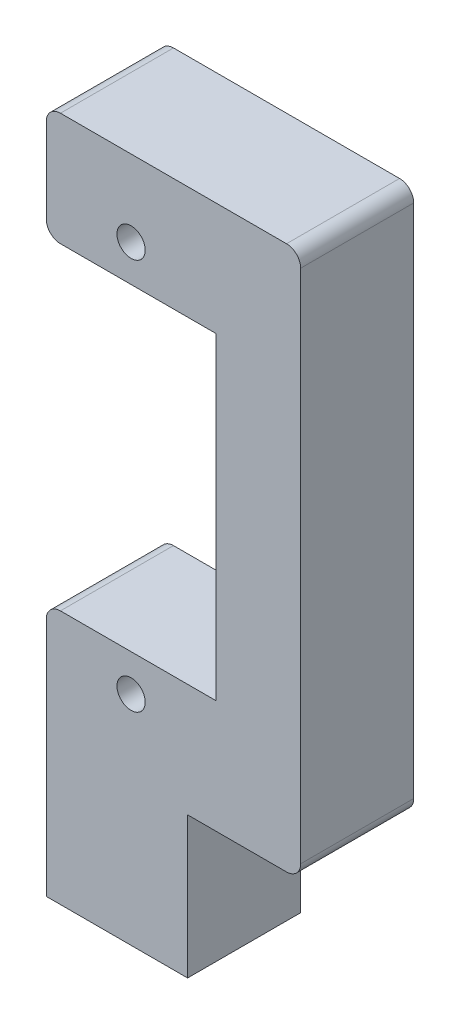
ISO-10303-21;
HEADER;
FILE_DESCRIPTION(('STEP AP214'),'2;1');
FILE_NAME('part.step','',(''),(''),'','','');
FILE_SCHEMA(('AUTOMOTIVE_DESIGN { 1 0 10303 214 1 1 1 1 }'));
ENDSEC;
DATA;
#1=APPLICATION_CONTEXT('core data for automotive mechanical design processes');
#2=APPLICATION_PROTOCOL_DEFINITION('international standard','automotive_design',2000,#1);
#3=PRODUCT_CONTEXT('',#1,'mechanical');
#4=PRODUCT('Part','Part','',(#3));
#5=PRODUCT_RELATED_PRODUCT_CATEGORY('part','',(#4));
#6=PRODUCT_DEFINITION_FORMATION('','',#4);
#7=PRODUCT_DEFINITION_CONTEXT('part definition',#1,'design');
#8=PRODUCT_DEFINITION('design','',#6,#7);
#9=PRODUCT_DEFINITION_SHAPE('','',#8);
#10=(LENGTH_UNIT() NAMED_UNIT(*) SI_UNIT(.MILLI.,.METRE.));
#11=(NAMED_UNIT(*) PLANE_ANGLE_UNIT() SI_UNIT($,.RADIAN.));
#12=(NAMED_UNIT(*) SI_UNIT($,.STERADIAN.) SOLID_ANGLE_UNIT());
#13=UNCERTAINTY_MEASURE_WITH_UNIT(LENGTH_MEASURE(1.E-05),#10,'distance_accuracy_value','');
#14=(GEOMETRIC_REPRESENTATION_CONTEXT(3) GLOBAL_UNCERTAINTY_ASSIGNED_CONTEXT((#13)) GLOBAL_UNIT_ASSIGNED_CONTEXT((#10,
#11,#12)) REPRESENTATION_CONTEXT('',''));
#15=CARTESIAN_POINT('',(0.,0.,0.));
#16=DIRECTION('',(0.,0.,1.));
#17=DIRECTION('',(1.,0.,0.));
#18=AXIS2_PLACEMENT_3D('',#15,#16,#17);
#19=CARTESIAN_POINT('',(0.,0.,8.));
#20=DIRECTION('',(0.,0.,1.));
#21=DIRECTION('',(1.,0.,0.));
#22=AXIS2_PLACEMENT_3D('',#19,#20,#21);
#23=PLANE('',#22);
#24=CARTESIAN_POINT('',(-4.,43.1,8.));
#25=DIRECTION('',(0.,0.,1.));
#26=DIRECTION('',(1.,0.,0.));
#27=AXIS2_PLACEMENT_3D('',#24,#25,#26);
#28=CIRCLE('',#27,1.);
#29=CARTESIAN_POINT('',(-3.,43.1,8.));
#30=VERTEX_POINT('',#29);
#31=EDGE_CURVE('E270',#30,#30,#28,.T.);
#32=ORIENTED_EDGE('',*,*,#31,.F.);
#33=EDGE_LOOP('',(#32));
#34=FACE_BOUND('',#33,.T.);
#35=DIRECTION('',(0.,-1.,0.));
#36=VECTOR('',#35,1.);
#37=CARTESIAN_POINT('',(-10.,48.5,8.));
#38=LINE('',#37,#36);
#39=CARTESIAN_POINT('',(-10.,47.5,8.));
#40=VERTEX_POINT('',#39);
#41=CARTESIAN_POINT('',(-10.,41.5,8.));
#42=VERTEX_POINT('',#41);
#43=EDGE_CURVE('E293',#40,#42,#38,.T.);
#44=ORIENTED_EDGE('',*,*,#43,.T.);
#45=CARTESIAN_POINT('',(-9.00000000000001,41.5,8.));
#46=DIRECTION('',(0.,0.,1.));
#47=DIRECTION('',(1.,0.,0.));
#48=AXIS2_PLACEMENT_3D('',#45,#46,#47);
#49=CIRCLE('',#48,1.);
#50=CARTESIAN_POINT('',(-9.00000000000001,40.5,8.));
#51=VERTEX_POINT('',#50);
#52=EDGE_CURVE('E198',#42,#51,#49,.T.);
#53=ORIENTED_EDGE('',*,*,#52,.T.);
#54=DIRECTION('',(1.,0.,0.));
#55=VECTOR('',#54,1.);
#56=CARTESIAN_POINT('',(-10.,40.5,8.));
#57=LINE('',#56,#55);
#58=CARTESIAN_POINT('',(2.,40.5,8.));
#59=VERTEX_POINT('',#58);
#60=EDGE_CURVE('E298',#51,#59,#57,.T.);
#61=ORIENTED_EDGE('',*,*,#60,.T.);
#62=DIRECTION('',(0.,-1.,0.));
#63=VECTOR('',#62,1.);
#64=CARTESIAN_POINT('',(2.,40.5,8.));
#65=LINE('',#64,#63);
#66=CARTESIAN_POINT('',(2.,18.,8.));
#67=VERTEX_POINT('',#66);
#68=EDGE_CURVE('E257',#59,#67,#65,.T.);
#69=ORIENTED_EDGE('',*,*,#68,.T.);
#70=DIRECTION('',(-1.,0.,0.));
#71=VECTOR('',#70,1.);
#72=CARTESIAN_POINT('',(2.,18.,8.));
#73=LINE('',#72,#71);
#74=CARTESIAN_POINT('',(-9.00000000000001,18.,8.));
#75=VERTEX_POINT('',#74);
#76=EDGE_CURVE('E300',#67,#75,#73,.T.);
#77=ORIENTED_EDGE('',*,*,#76,.T.);
#78=CARTESIAN_POINT('',(-9.00000000000001,17.,8.));
#79=DIRECTION('',(0.,0.,1.));
#80=DIRECTION('',(1.,0.,0.));
#81=AXIS2_PLACEMENT_3D('',#78,#79,#80);
#82=CIRCLE('',#81,1.);
#83=CARTESIAN_POINT('',(-10.,17.,8.));
#84=VERTEX_POINT('',#83);
#85=EDGE_CURVE('E50',#75,#84,#82,.T.);
#86=ORIENTED_EDGE('',*,*,#85,.T.);
#87=DIRECTION('',(0.,-1.,0.));
#88=VECTOR('',#87,1.);
#89=CARTESIAN_POINT('',(-10.,18.,8.));
#90=LINE('',#89,#88);
#91=CARTESIAN_POINT('',(-10.,0.,8.));
#92=VERTEX_POINT('',#91);
#93=EDGE_CURVE('E159',#84,#92,#90,.T.);
#94=ORIENTED_EDGE('',*,*,#93,.T.);
#95=DIRECTION('',(1.,0.,0.));
#96=VECTOR('',#95,1.);
#97=CARTESIAN_POINT('',(-10.,0.,8.));
#98=LINE('',#97,#96);
#99=CARTESIAN_POINT('',(0.,0.,8.));
#100=VERTEX_POINT('',#99);
#101=EDGE_CURVE('E154',#92,#100,#98,.T.);
#102=ORIENTED_EDGE('',*,*,#101,.T.);
#103=DIRECTION('',(0.,1.,0.));
#104=VECTOR('',#103,1.);
#105=CARTESIAN_POINT('',(0.,0.,8.));
#106=LINE('',#105,#104);
#107=CARTESIAN_POINT('',(0.,10.,8.));
#108=VERTEX_POINT('',#107);
#109=EDGE_CURVE('E143',#100,#108,#106,.T.);
#110=ORIENTED_EDGE('',*,*,#109,.T.);
#111=DIRECTION('',(1.,0.,0.));
#112=VECTOR('',#111,1.);
#113=CARTESIAN_POINT('',(0.,10.,8.));
#114=LINE('',#113,#112);
#115=CARTESIAN_POINT('',(7.,10.,8.));
#116=VERTEX_POINT('',#115);
#117=EDGE_CURVE('E153',#108,#116,#114,.T.);
#118=ORIENTED_EDGE('',*,*,#117,.T.);
#119=CARTESIAN_POINT('',(7.,11.,8.));
#120=DIRECTION('',(0.,0.,1.));
#121=DIRECTION('',(1.,0.,0.));
#122=AXIS2_PLACEMENT_3D('',#119,#120,#121);
#123=CIRCLE('',#122,1.);
#124=CARTESIAN_POINT('',(8.,11.,8.));
#125=VERTEX_POINT('',#124);
#126=EDGE_CURVE('E195',#116,#125,#123,.T.);
#127=ORIENTED_EDGE('',*,*,#126,.T.);
#128=DIRECTION('',(0.,1.,0.));
#129=VECTOR('',#128,1.);
#130=CARTESIAN_POINT('',(8.,10.,8.));
#131=LINE('',#130,#129);
#132=CARTESIAN_POINT('',(7.99999999999999,47.5,8.));
#133=VERTEX_POINT('',#132);
#134=EDGE_CURVE('E288',#125,#133,#131,.T.);
#135=ORIENTED_EDGE('',*,*,#134,.T.);
#136=CARTESIAN_POINT('',(6.99999999999999,47.5,8.));
#137=DIRECTION('',(0.,0.,1.));
#138=DIRECTION('',(1.,0.,0.));
#139=AXIS2_PLACEMENT_3D('',#136,#137,#138);
#140=CIRCLE('',#139,1.);
#141=CARTESIAN_POINT('',(6.99999999999999,48.5,8.));
#142=VERTEX_POINT('',#141);
#143=EDGE_CURVE('E191',#133,#142,#140,.T.);
#144=ORIENTED_EDGE('',*,*,#143,.T.);
#145=DIRECTION('',(-1.,0.,0.));
#146=VECTOR('',#145,1.);
#147=CARTESIAN_POINT('',(7.99999999999999,48.5,8.));
#148=LINE('',#147,#146);
#149=CARTESIAN_POINT('',(-9.00000000000001,48.5,8.));
#150=VERTEX_POINT('',#149);
#151=EDGE_CURVE('E220',#142,#150,#148,.T.);
#152=ORIENTED_EDGE('',*,*,#151,.T.);
#153=CARTESIAN_POINT('',(-9.00000000000001,47.5,8.));
#154=DIRECTION('',(0.,0.,1.));
#155=DIRECTION('',(1.,0.,0.));
#156=AXIS2_PLACEMENT_3D('',#153,#154,#155);
#157=CIRCLE('',#156,1.);
#158=EDGE_CURVE('E193',#150,#40,#157,.T.);
#159=ORIENTED_EDGE('',*,*,#158,.T.);
#160=EDGE_LOOP('',(#44,#53,#61,#69,#77,#86,#94,#102,#110,#118,#127,#135,#144,#152,#159));
#161=FACE_BOUND('',#160,.T.);
#162=CARTESIAN_POINT('',(-4.,15.4,8.));
#163=DIRECTION('',(0.,0.,1.));
#164=DIRECTION('',(1.,0.,0.));
#165=AXIS2_PLACEMENT_3D('',#162,#163,#164);
#166=CIRCLE('',#165,1.);
#167=CARTESIAN_POINT('',(-3.,15.4,8.));
#168=VERTEX_POINT('',#167);
#169=EDGE_CURVE('E476',#168,#168,#166,.T.);
#170=ORIENTED_EDGE('',*,*,#169,.F.);
#171=EDGE_LOOP('',(#170));
#172=FACE_BOUND('',#171,.T.);
#173=ADVANCED_FACE('F35',(#34,#161,#172),#23,.T.);
#174=CARTESIAN_POINT('',(0.,0.,0.));
#175=DIRECTION('',(0.,0.,1.));
#176=DIRECTION('',(1.,0.,0.));
#177=AXIS2_PLACEMENT_3D('',#174,#175,#176);
#178=PLANE('',#177);
#179=DIRECTION('',(1.,0.,0.));
#180=VECTOR('',#179,1.);
#181=CARTESIAN_POINT('',(-10.,40.5,0.));
#182=LINE('',#181,#180);
#183=CARTESIAN_POINT('',(-9.00000000000001,40.5,0.));
#184=VERTEX_POINT('',#183);
#185=CARTESIAN_POINT('',(2.,40.5,0.));
#186=VERTEX_POINT('',#185);
#187=EDGE_CURVE('E234',#184,#186,#182,.T.);
#188=ORIENTED_EDGE('',*,*,#187,.F.);
#189=CARTESIAN_POINT('',(-9.00000000000001,41.5,0.));
#190=DIRECTION('',(0.,0.,1.));
#191=DIRECTION('',(1.,0.,0.));
#192=AXIS2_PLACEMENT_3D('',#189,#190,#191);
#193=CIRCLE('',#192,1.);
#194=CARTESIAN_POINT('',(-10.,41.5,0.));
#195=VERTEX_POINT('',#194);
#196=EDGE_CURVE('E184',#184,#195,#193,.F.);
#197=ORIENTED_EDGE('',*,*,#196,.T.);
#198=DIRECTION('',(0.,-1.,0.));
#199=VECTOR('',#198,1.);
#200=CARTESIAN_POINT('',(-10.,48.5,0.));
#201=LINE('',#200,#199);
#202=CARTESIAN_POINT('',(-10.,47.5,0.));
#203=VERTEX_POINT('',#202);
#204=EDGE_CURVE('E230',#203,#195,#201,.T.);
#205=ORIENTED_EDGE('',*,*,#204,.F.);
#206=CARTESIAN_POINT('',(-9.00000000000001,47.5,0.));
#207=DIRECTION('',(0.,0.,1.));
#208=DIRECTION('',(1.,0.,0.));
#209=AXIS2_PLACEMENT_3D('',#206,#207,#208);
#210=CIRCLE('',#209,1.);
#211=CARTESIAN_POINT('',(-9.00000000000001,48.5,0.));
#212=VERTEX_POINT('',#211);
#213=EDGE_CURVE('E178',#203,#212,#210,.F.);
#214=ORIENTED_EDGE('',*,*,#213,.T.);
#215=DIRECTION('',(-1.,0.,0.));
#216=VECTOR('',#215,1.);
#217=CARTESIAN_POINT('',(7.99999999999999,48.5,0.));
#218=LINE('',#217,#216);
#219=CARTESIAN_POINT('',(6.99999999999999,48.5,0.));
#220=VERTEX_POINT('',#219);
#221=EDGE_CURVE('E217',#220,#212,#218,.T.);
#222=ORIENTED_EDGE('',*,*,#221,.F.);
#223=CARTESIAN_POINT('',(6.99999999999999,47.5,0.));
#224=DIRECTION('',(0.,0.,1.));
#225=DIRECTION('',(1.,0.,0.));
#226=AXIS2_PLACEMENT_3D('',#223,#224,#225);
#227=CIRCLE('',#226,1.);
#228=CARTESIAN_POINT('',(7.99999999999999,47.5,0.));
#229=VERTEX_POINT('',#228);
#230=EDGE_CURVE('E171',#220,#229,#227,.F.);
#231=ORIENTED_EDGE('',*,*,#230,.T.);
#232=DIRECTION('',(0.,1.,0.));
#233=VECTOR('',#232,1.);
#234=CARTESIAN_POINT('',(8.,10.,0.));
#235=LINE('',#234,#233);
#236=CARTESIAN_POINT('',(8.,11.,0.));
#237=VERTEX_POINT('',#236);
#238=EDGE_CURVE('E231',#237,#229,#235,.T.);
#239=ORIENTED_EDGE('',*,*,#238,.F.);
#240=CARTESIAN_POINT('',(7.,11.,0.));
#241=DIRECTION('',(0.,0.,1.));
#242=DIRECTION('',(1.,0.,0.));
#243=AXIS2_PLACEMENT_3D('',#240,#241,#242);
#244=CIRCLE('',#243,1.);
#245=CARTESIAN_POINT('',(7.,10.,0.));
#246=VERTEX_POINT('',#245);
#247=EDGE_CURVE('E180',#237,#246,#244,.F.);
#248=ORIENTED_EDGE('',*,*,#247,.T.);
#249=DIRECTION('',(1.,0.,0.));
#250=VECTOR('',#249,1.);
#251=CARTESIAN_POINT('',(0.,10.,0.));
#252=LINE('',#251,#250);
#253=CARTESIAN_POINT('',(0.,10.,0.));
#254=VERTEX_POINT('',#253);
#255=EDGE_CURVE('E236',#254,#246,#252,.T.);
#256=ORIENTED_EDGE('',*,*,#255,.F.);
#257=DIRECTION('',(0.,1.,0.));
#258=VECTOR('',#257,1.);
#259=CARTESIAN_POINT('',(0.,0.,0.));
#260=LINE('',#259,#258);
#261=CARTESIAN_POINT('',(0.,0.,0.));
#262=VERTEX_POINT('',#261);
#263=EDGE_CURVE('E269',#262,#254,#260,.T.);
#264=ORIENTED_EDGE('',*,*,#263,.F.);
#265=DIRECTION('',(1.,0.,0.));
#266=VECTOR('',#265,1.);
#267=CARTESIAN_POINT('',(-10.,0.,0.));
#268=LINE('',#267,#266);
#269=CARTESIAN_POINT('',(-10.,0.,0.));
#270=VERTEX_POINT('',#269);
#271=EDGE_CURVE('E167',#270,#262,#268,.T.);
#272=ORIENTED_EDGE('',*,*,#271,.F.);
#273=DIRECTION('',(0.,-1.,0.));
#274=VECTOR('',#273,1.);
#275=CARTESIAN_POINT('',(-10.,10.,0.));
#276=LINE('',#275,#274);
#277=CARTESIAN_POINT('',(-10.,17.,0.));
#278=VERTEX_POINT('',#277);
#279=EDGE_CURVE('E163',#278,#270,#276,.T.);
#280=ORIENTED_EDGE('',*,*,#279,.F.);
#281=CARTESIAN_POINT('',(-9.00000000000001,17.,0.));
#282=DIRECTION('',(0.,0.,1.));
#283=DIRECTION('',(1.,0.,0.));
#284=AXIS2_PLACEMENT_3D('',#281,#282,#283);
#285=CIRCLE('',#284,1.);
#286=CARTESIAN_POINT('',(-9.00000000000001,18.,0.));
#287=VERTEX_POINT('',#286);
#288=EDGE_CURVE('E182',#278,#287,#285,.F.);
#289=ORIENTED_EDGE('',*,*,#288,.T.);
#290=DIRECTION('',(-1.,0.,0.));
#291=VECTOR('',#290,1.);
#292=CARTESIAN_POINT('',(2.,18.,0.));
#293=LINE('',#292,#291);
#294=CARTESIAN_POINT('',(2.,18.,0.));
#295=VERTEX_POINT('',#294);
#296=EDGE_CURVE('E243',#295,#287,#293,.T.);
#297=ORIENTED_EDGE('',*,*,#296,.F.);
#298=DIRECTION('',(0.,-1.,0.));
#299=VECTOR('',#298,1.);
#300=CARTESIAN_POINT('',(2.,40.5,0.));
#301=LINE('',#300,#299);
#302=EDGE_CURVE('E241',#186,#295,#301,.T.);
#303=ORIENTED_EDGE('',*,*,#302,.F.);
#304=EDGE_LOOP('',(#188,#197,#205,#214,#222,#231,#239,#248,#256,#264,#272,#280,#289,#297,#303));
#305=FACE_BOUND('',#304,.T.);
#306=CARTESIAN_POINT('',(-4.,43.1,0.));
#307=DIRECTION('',(0.,0.,1.));
#308=DIRECTION('',(1.,0.,0.));
#309=AXIS2_PLACEMENT_3D('',#306,#307,#308);
#310=CIRCLE('',#309,1.);
#311=CARTESIAN_POINT('',(-3.,43.1,0.));
#312=VERTEX_POINT('',#311);
#313=EDGE_CURVE('E274',#312,#312,#310,.T.);
#314=ORIENTED_EDGE('',*,*,#313,.T.);
#315=EDGE_LOOP('',(#314));
#316=FACE_BOUND('',#315,.T.);
#317=CARTESIAN_POINT('',(-4.,15.4,0.));
#318=DIRECTION('',(0.,0.,1.));
#319=DIRECTION('',(1.,0.,0.));
#320=AXIS2_PLACEMENT_3D('',#317,#318,#319);
#321=CIRCLE('',#320,1.);
#322=CARTESIAN_POINT('',(-3.,15.4,0.));
#323=VERTEX_POINT('',#322);
#324=EDGE_CURVE('E479',#323,#323,#321,.T.);
#325=ORIENTED_EDGE('',*,*,#324,.T.);
#326=EDGE_LOOP('',(#325));
#327=FACE_BOUND('',#326,.T.);
#328=ADVANCED_FACE('F225',(#305,#316,#327),#178,.F.);
#329=CARTESIAN_POINT('',(-10.,0.,8.));
#330=DIRECTION('',(0.,1.,0.));
#331=DIRECTION('',(0.,0.,1.));
#332=AXIS2_PLACEMENT_3D('',#329,#330,#331);
#333=PLANE('',#332);
#334=ORIENTED_EDGE('',*,*,#271,.T.);
#335=DIRECTION('',(0.,0.,-1.));
#336=VECTOR('',#335,1.);
#337=CARTESIAN_POINT('',(0.,0.,8.));
#338=LINE('',#337,#336);
#339=EDGE_CURVE('E147',#100,#262,#338,.T.);
#340=ORIENTED_EDGE('',*,*,#339,.F.);
#341=ORIENTED_EDGE('',*,*,#101,.F.);
#342=DIRECTION('',(0.,0.,-1.));
#343=VECTOR('',#342,1.);
#344=CARTESIAN_POINT('',(-10.,0.,8.));
#345=LINE('',#344,#343);
#346=EDGE_CURVE('E246',#92,#270,#345,.T.);
#347=ORIENTED_EDGE('',*,*,#346,.T.);
#348=EDGE_LOOP('',(#334,#340,#341,#347));
#349=FACE_BOUND('',#348,.T.);
#350=ADVANCED_FACE('F165',(#349),#333,.F.);
#351=CARTESIAN_POINT('',(0.,0.,8.));
#352=DIRECTION('',(-1.,0.,0.));
#353=DIRECTION('',(0.,0.,1.));
#354=AXIS2_PLACEMENT_3D('',#351,#352,#353);
#355=PLANE('',#354);
#356=ORIENTED_EDGE('',*,*,#263,.T.);
#357=DIRECTION('',(0.,0.,-1.));
#358=VECTOR('',#357,1.);
#359=CARTESIAN_POINT('',(0.,10.,8.));
#360=LINE('',#359,#358);
#361=EDGE_CURVE('E150',#108,#254,#360,.T.);
#362=ORIENTED_EDGE('',*,*,#361,.F.);
#363=ORIENTED_EDGE('',*,*,#109,.F.);
#364=ORIENTED_EDGE('',*,*,#339,.T.);
#365=EDGE_LOOP('',(#356,#362,#363,#364));
#366=FACE_BOUND('',#365,.T.);
#367=ADVANCED_FACE('F145',(#366),#355,.F.);
#368=CARTESIAN_POINT('',(0.,10.,8.));
#369=DIRECTION('',(0.,1.,0.));
#370=DIRECTION('',(0.,0.,1.));
#371=AXIS2_PLACEMENT_3D('',#368,#369,#370);
#372=PLANE('',#371);
#373=ORIENTED_EDGE('',*,*,#255,.T.);
#374=DIRECTION('',(0.,0.,-1.));
#375=VECTOR('',#374,1.);
#376=CARTESIAN_POINT('',(7.,10.,8.));
#377=LINE('',#376,#375);
#378=EDGE_CURVE('E209',#246,#116,#377,.F.);
#379=ORIENTED_EDGE('',*,*,#378,.T.);
#380=ORIENTED_EDGE('',*,*,#117,.F.);
#381=ORIENTED_EDGE('',*,*,#361,.T.);
#382=EDGE_LOOP('',(#373,#379,#380,#381));
#383=FACE_BOUND('',#382,.T.);
#384=ADVANCED_FACE('F281',(#383),#372,.F.);
#385=CARTESIAN_POINT('',(8.,10.,8.));
#386=DIRECTION('',(-1.,0.,0.));
#387=DIRECTION('',(0.,-1.,0.));
#388=AXIS2_PLACEMENT_3D('',#385,#386,#387);
#389=PLANE('',#388);
#390=ORIENTED_EDGE('',*,*,#134,.F.);
#391=DIRECTION('',(0.,0.,-1.));
#392=VECTOR('',#391,1.);
#393=CARTESIAN_POINT('',(8.,11.,8.));
#394=LINE('',#393,#392);
#395=EDGE_CURVE('E206',#125,#237,#394,.T.);
#396=ORIENTED_EDGE('',*,*,#395,.T.);
#397=ORIENTED_EDGE('',*,*,#238,.T.);
#398=DIRECTION('',(0.,0.,-1.));
#399=VECTOR('',#398,1.);
#400=CARTESIAN_POINT('',(7.99999999999999,47.5,8.));
#401=LINE('',#400,#399);
#402=EDGE_CURVE('E204',#229,#133,#401,.F.);
#403=ORIENTED_EDGE('',*,*,#402,.T.);
#404=EDGE_LOOP('',(#390,#396,#397,#403));
#405=FACE_BOUND('',#404,.T.);
#406=ADVANCED_FACE('F290',(#405),#389,.F.);
#407=CARTESIAN_POINT('',(7.99999999999999,48.5,8.));
#408=DIRECTION('',(0.,-1.,0.));
#409=DIRECTION('',(1.,0.,0.));
#410=AXIS2_PLACEMENT_3D('',#407,#408,#409);
#411=PLANE('',#410);
#412=ORIENTED_EDGE('',*,*,#221,.T.);
#413=DIRECTION('',(0.,0.,-1.));
#414=VECTOR('',#413,1.);
#415=CARTESIAN_POINT('',(-9.00000000000001,48.5,8.));
#416=LINE('',#415,#414);
#417=EDGE_CURVE('E11',#212,#150,#416,.F.);
#418=ORIENTED_EDGE('',*,*,#417,.T.);
#419=ORIENTED_EDGE('',*,*,#151,.F.);
#420=DIRECTION('',(0.,0.,-1.));
#421=VECTOR('',#420,1.);
#422=CARTESIAN_POINT('',(6.99999999999999,48.5,8.));
#423=LINE('',#422,#421);
#424=EDGE_CURVE('E43',#142,#220,#423,.T.);
#425=ORIENTED_EDGE('',*,*,#424,.T.);
#426=EDGE_LOOP('',(#412,#418,#419,#425));
#427=FACE_BOUND('',#426,.T.);
#428=ADVANCED_FACE('F216',(#427),#411,.F.);
#429=CARTESIAN_POINT('',(-10.,48.5,8.));
#430=DIRECTION('',(1.,0.,0.));
#431=DIRECTION('',(0.,0.,-1.));
#432=AXIS2_PLACEMENT_3D('',#429,#430,#431);
#433=PLANE('',#432);
#434=ORIENTED_EDGE('',*,*,#204,.T.);
#435=DIRECTION('',(0.,0.,-1.));
#436=VECTOR('',#435,1.);
#437=CARTESIAN_POINT('',(-10.,41.5,8.));
#438=LINE('',#437,#436);
#439=EDGE_CURVE('E189',#195,#42,#438,.F.);
#440=ORIENTED_EDGE('',*,*,#439,.T.);
#441=ORIENTED_EDGE('',*,*,#43,.F.);
#442=DIRECTION('',(0.,0.,-1.));
#443=VECTOR('',#442,1.);
#444=CARTESIAN_POINT('',(-10.,47.5,8.));
#445=LINE('',#444,#443);
#446=EDGE_CURVE('E186',#40,#203,#445,.T.);
#447=ORIENTED_EDGE('',*,*,#446,.T.);
#448=EDGE_LOOP('',(#434,#440,#441,#447));
#449=FACE_BOUND('',#448,.T.);
#450=ADVANCED_FACE('F308',(#449),#433,.F.);
#451=CARTESIAN_POINT('',(-10.,40.5,8.));
#452=DIRECTION('',(0.,1.,0.));
#453=DIRECTION('',(0.,0.,1.));
#454=AXIS2_PLACEMENT_3D('',#451,#452,#453);
#455=PLANE('',#454);
#456=ORIENTED_EDGE('',*,*,#60,.F.);
#457=DIRECTION('',(0.,0.,-1.));
#458=VECTOR('',#457,1.);
#459=CARTESIAN_POINT('',(-9.00000000000001,40.5,8.));
#460=LINE('',#459,#458);
#461=EDGE_CURVE('E168',#51,#184,#460,.T.);
#462=ORIENTED_EDGE('',*,*,#461,.T.);
#463=ORIENTED_EDGE('',*,*,#187,.T.);
#464=DIRECTION('',(0.,0.,-1.));
#465=VECTOR('',#464,1.);
#466=CARTESIAN_POINT('',(2.,40.5,8.));
#467=LINE('',#466,#465);
#468=EDGE_CURVE('E173',#59,#186,#467,.T.);
#469=ORIENTED_EDGE('',*,*,#468,.F.);
#470=EDGE_LOOP('',(#456,#462,#463,#469));
#471=FACE_BOUND('',#470,.T.);
#472=ADVANCED_FACE('F303',(#471),#455,.F.);
#473=CARTESIAN_POINT('',(2.,40.5,8.));
#474=DIRECTION('',(1.,0.,0.));
#475=DIRECTION('',(0.,1.,0.));
#476=AXIS2_PLACEMENT_3D('',#473,#474,#475);
#477=PLANE('',#476);
#478=ORIENTED_EDGE('',*,*,#302,.T.);
#479=DIRECTION('',(0.,0.,-1.));
#480=VECTOR('',#479,1.);
#481=CARTESIAN_POINT('',(2.,18.,8.));
#482=LINE('',#481,#480);
#483=EDGE_CURVE('E248',#67,#295,#482,.T.);
#484=ORIENTED_EDGE('',*,*,#483,.F.);
#485=ORIENTED_EDGE('',*,*,#68,.F.);
#486=ORIENTED_EDGE('',*,*,#468,.T.);
#487=EDGE_LOOP('',(#478,#484,#485,#486));
#488=FACE_BOUND('',#487,.T.);
#489=ADVANCED_FACE('F255',(#488),#477,.F.);
#490=CARTESIAN_POINT('',(2.,18.,8.));
#491=DIRECTION('',(0.,-1.,0.));
#492=DIRECTION('',(0.,0.,-1.));
#493=AXIS2_PLACEMENT_3D('',#490,#491,#492);
#494=PLANE('',#493);
#495=ORIENTED_EDGE('',*,*,#296,.T.);
#496=DIRECTION('',(0.,0.,-1.));
#497=VECTOR('',#496,1.);
#498=CARTESIAN_POINT('',(-9.00000000000001,18.,8.));
#499=LINE('',#498,#497);
#500=EDGE_CURVE('E58',#287,#75,#499,.F.);
#501=ORIENTED_EDGE('',*,*,#500,.T.);
#502=ORIENTED_EDGE('',*,*,#76,.F.);
#503=ORIENTED_EDGE('',*,*,#483,.T.);
#504=EDGE_LOOP('',(#495,#501,#502,#503));
#505=FACE_BOUND('',#504,.T.);
#506=ADVANCED_FACE('F262',(#505),#494,.F.);
#507=CARTESIAN_POINT('',(-10.,10.,8.));
#508=DIRECTION('',(1.,0.,0.));
#509=DIRECTION('',(0.,1.,0.));
#510=AXIS2_PLACEMENT_3D('',#507,#508,#509);
#511=PLANE('',#510);
#512=ORIENTED_EDGE('',*,*,#93,.F.);
#513=DIRECTION('',(0.,0.,-1.));
#514=VECTOR('',#513,1.);
#515=CARTESIAN_POINT('',(-10.,17.,8.));
#516=LINE('',#515,#514);
#517=EDGE_CURVE('E200',#84,#278,#516,.T.);
#518=ORIENTED_EDGE('',*,*,#517,.T.);
#519=ORIENTED_EDGE('',*,*,#279,.T.);
#520=ORIENTED_EDGE('',*,*,#346,.F.);
#521=EDGE_LOOP('',(#512,#518,#519,#520));
#522=FACE_BOUND('',#521,.T.);
#523=ADVANCED_FACE('F267',(#522),#511,.F.);
#524=CARTESIAN_POINT('',(-4.,43.1,8.));
#525=DIRECTION('',(0.,0.,-1.));
#526=DIRECTION('',(-1.,0.,0.));
#527=AXIS2_PLACEMENT_3D('',#524,#525,#526);
#528=CYLINDRICAL_SURFACE('',#527,1.);
#529=ORIENTED_EDGE('',*,*,#31,.T.);
#530=EDGE_LOOP('',(#529));
#531=FACE_BOUND('',#530,.T.);
#532=ORIENTED_EDGE('',*,*,#313,.F.);
#533=EDGE_LOOP('',(#532));
#534=FACE_BOUND('',#533,.T.);
#535=ADVANCED_FACE('F327',(#531,#534),#528,.F.);
#536=CARTESIAN_POINT('',(-4.,15.4,8.));
#537=DIRECTION('',(0.,0.,-1.));
#538=DIRECTION('',(-1.,0.,0.));
#539=AXIS2_PLACEMENT_3D('',#536,#537,#538);
#540=CYLINDRICAL_SURFACE('',#539,1.);
#541=ORIENTED_EDGE('',*,*,#169,.T.);
#542=EDGE_LOOP('',(#541));
#543=FACE_BOUND('',#542,.T.);
#544=ORIENTED_EDGE('',*,*,#324,.F.);
#545=EDGE_LOOP('',(#544));
#546=FACE_BOUND('',#545,.T.);
#547=ADVANCED_FACE('F352',(#543,#546),#540,.F.);
#548=CARTESIAN_POINT('',(-9.00000000000001,41.5,8.));
#549=DIRECTION('',(0.,0.,-1.));
#550=DIRECTION('',(-1.,0.,0.));
#551=AXIS2_PLACEMENT_3D('',#548,#549,#550);
#552=CYLINDRICAL_SURFACE('',#551,1.);
#553=ORIENTED_EDGE('',*,*,#52,.F.);
#554=ORIENTED_EDGE('',*,*,#439,.F.);
#555=ORIENTED_EDGE('',*,*,#196,.F.);
#556=ORIENTED_EDGE('',*,*,#461,.F.);
#557=EDGE_LOOP('',(#553,#554,#555,#556));
#558=FACE_BOUND('',#557,.T.);
#559=ADVANCED_FACE('F305',(#558),#552,.T.);
#560=CARTESIAN_POINT('',(-9.00000000000001,17.,8.));
#561=DIRECTION('',(0.,0.,-1.));
#562=DIRECTION('',(-1.,0.,0.));
#563=AXIS2_PLACEMENT_3D('',#560,#561,#562);
#564=CYLINDRICAL_SURFACE('',#563,1.);
#565=ORIENTED_EDGE('',*,*,#85,.F.);
#566=ORIENTED_EDGE('',*,*,#500,.F.);
#567=ORIENTED_EDGE('',*,*,#288,.F.);
#568=ORIENTED_EDGE('',*,*,#517,.F.);
#569=EDGE_LOOP('',(#565,#566,#567,#568));
#570=FACE_BOUND('',#569,.T.);
#571=ADVANCED_FACE('F264',(#570),#564,.T.);
#572=CARTESIAN_POINT('',(7.,11.,8.));
#573=DIRECTION('',(0.,0.,-1.));
#574=DIRECTION('',(-1.,0.,0.));
#575=AXIS2_PLACEMENT_3D('',#572,#573,#574);
#576=CYLINDRICAL_SURFACE('',#575,1.);
#577=ORIENTED_EDGE('',*,*,#126,.F.);
#578=ORIENTED_EDGE('',*,*,#378,.F.);
#579=ORIENTED_EDGE('',*,*,#247,.F.);
#580=ORIENTED_EDGE('',*,*,#395,.F.);
#581=EDGE_LOOP('',(#577,#578,#579,#580));
#582=FACE_BOUND('',#581,.T.);
#583=ADVANCED_FACE('F284',(#582),#576,.T.);
#584=CARTESIAN_POINT('',(-9.00000000000001,47.5,8.));
#585=DIRECTION('',(0.,0.,-1.));
#586=DIRECTION('',(-1.,0.,0.));
#587=AXIS2_PLACEMENT_3D('',#584,#585,#586);
#588=CYLINDRICAL_SURFACE('',#587,1.);
#589=ORIENTED_EDGE('',*,*,#158,.F.);
#590=ORIENTED_EDGE('',*,*,#417,.F.);
#591=ORIENTED_EDGE('',*,*,#213,.F.);
#592=ORIENTED_EDGE('',*,*,#446,.F.);
#593=EDGE_LOOP('',(#589,#590,#591,#592));
#594=FACE_BOUND('',#593,.T.);
#595=ADVANCED_FACE('F313',(#594),#588,.T.);
#596=CARTESIAN_POINT('',(6.99999999999999,47.5,8.));
#597=DIRECTION('',(0.,0.,-1.));
#598=DIRECTION('',(-1.,0.,0.));
#599=AXIS2_PLACEMENT_3D('',#596,#597,#598);
#600=CYLINDRICAL_SURFACE('',#599,1.);
#601=ORIENTED_EDGE('',*,*,#143,.F.);
#602=ORIENTED_EDGE('',*,*,#402,.F.);
#603=ORIENTED_EDGE('',*,*,#230,.F.);
#604=ORIENTED_EDGE('',*,*,#424,.F.);
#605=EDGE_LOOP('',(#601,#602,#603,#604));
#606=FACE_BOUND('',#605,.T.);
#607=ADVANCED_FACE('F37',(#606),#600,.T.);
#608=CLOSED_SHELL('',(#173,#328,#350,#367,#384,#406,#428,#450,#472,#489,#506,#523,#535,#547,
#559,#571,#583,#595,#607));
#609=MANIFOLD_SOLID_BREP('B2',#608);
#610=ADVANCED_BREP_SHAPE_REPRESENTATION('',(#18,#609),#14);
#611=SHAPE_DEFINITION_REPRESENTATION(#9,#610);
ENDSEC;
END-ISO-10303-21;
